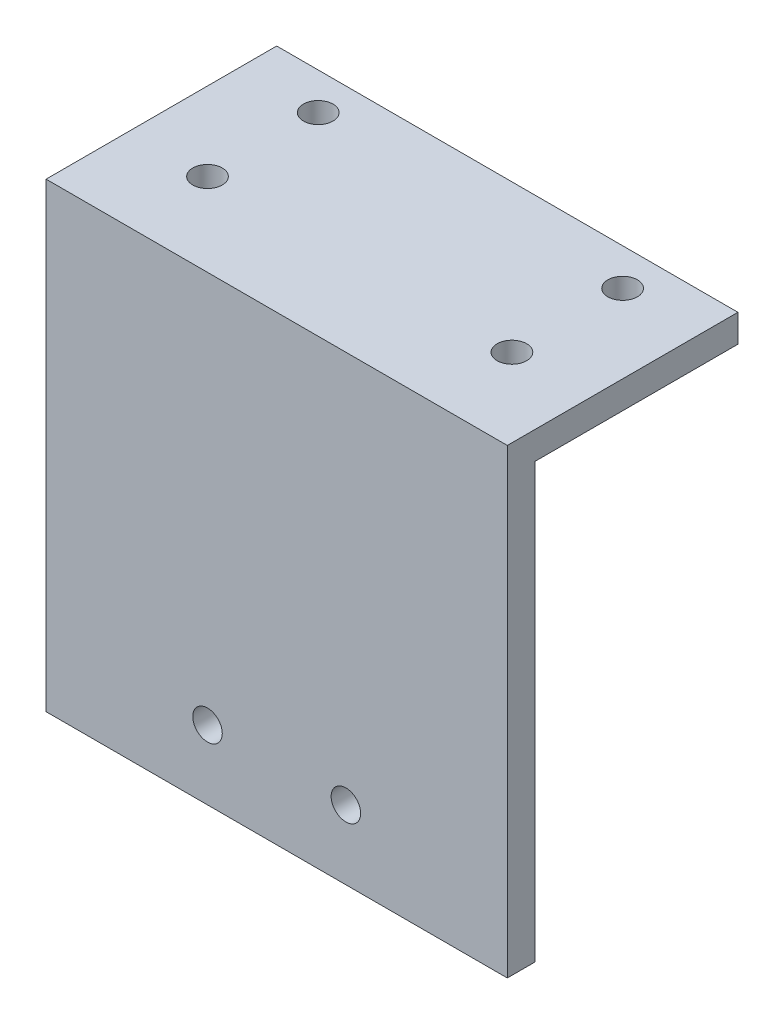
ISO-10303-21;
HEADER;
FILE_DESCRIPTION(('STEP AP214'),'2;1');
FILE_NAME('part.step','',(''),(''),'','','');
FILE_SCHEMA(('AUTOMOTIVE_DESIGN { 1 0 10303 214 1 1 1 1 }'));
ENDSEC;
DATA;
#1=APPLICATION_CONTEXT('core data for automotive mechanical design processes');
#2=APPLICATION_PROTOCOL_DEFINITION('international standard','automotive_design',2000,#1);
#3=PRODUCT_CONTEXT('',#1,'mechanical');
#4=PRODUCT('Part','Part','',(#3));
#5=PRODUCT_RELATED_PRODUCT_CATEGORY('part','',(#4));
#6=PRODUCT_DEFINITION_FORMATION('','',#4);
#7=PRODUCT_DEFINITION_CONTEXT('part definition',#1,'design');
#8=PRODUCT_DEFINITION('design','',#6,#7);
#9=PRODUCT_DEFINITION_SHAPE('','',#8);
#10=(LENGTH_UNIT() NAMED_UNIT(*) SI_UNIT(.MILLI.,.METRE.));
#11=(NAMED_UNIT(*) PLANE_ANGLE_UNIT() SI_UNIT($,.RADIAN.));
#12=(NAMED_UNIT(*) SI_UNIT($,.STERADIAN.) SOLID_ANGLE_UNIT());
#13=UNCERTAINTY_MEASURE_WITH_UNIT(LENGTH_MEASURE(1.E-05),#10,'distance_accuracy_value','');
#14=(GEOMETRIC_REPRESENTATION_CONTEXT(3) GLOBAL_UNCERTAINTY_ASSIGNED_CONTEXT((#13)) GLOBAL_UNIT_ASSIGNED_CONTEXT((#10,
#11,#12)) REPRESENTATION_CONTEXT('',''));
#15=CARTESIAN_POINT('',(0.,0.,0.));
#16=DIRECTION('',(0.,0.,1.));
#17=DIRECTION('',(1.,0.,0.));
#18=AXIS2_PLACEMENT_3D('',#15,#16,#17);
#19=CARTESIAN_POINT('',(50.,0.,0.));
#20=DIRECTION('',(0.,0.,-1.));
#21=DIRECTION('',(-1.,0.,0.));
#22=AXIS2_PLACEMENT_3D('',#19,#20,#21);
#23=PLANE('',#22);
#24=CARTESIAN_POINT('',(17.5,7.5,0.));
#25=DIRECTION('',(0.,0.,1.));
#26=DIRECTION('',(1.,0.,0.));
#27=AXIS2_PLACEMENT_3D('',#24,#25,#26);
#28=CIRCLE('',#27,1.6);
#29=CARTESIAN_POINT('',(19.1,7.5,0.));
#30=VERTEX_POINT('',#29);
#31=EDGE_CURVE('E143',#30,#30,#28,.T.);
#32=ORIENTED_EDGE('',*,*,#31,.F.);
#33=EDGE_LOOP('',(#32));
#34=FACE_BOUND('',#33,.T.);
#35=CARTESIAN_POINT('',(32.5,7.5,0.));
#36=DIRECTION('',(0.,0.,1.));
#37=DIRECTION('',(1.,0.,0.));
#38=AXIS2_PLACEMENT_3D('',#35,#36,#37);
#39=CIRCLE('',#38,1.6);
#40=CARTESIAN_POINT('',(34.1,7.5,0.));
#41=VERTEX_POINT('',#40);
#42=EDGE_CURVE('E149',#41,#41,#39,.T.);
#43=ORIENTED_EDGE('',*,*,#42,.F.);
#44=EDGE_LOOP('',(#43));
#45=FACE_BOUND('',#44,.T.);
#46=DIRECTION('',(0.,-1.,0.));
#47=VECTOR('',#46,1.);
#48=CARTESIAN_POINT('',(0.,0.,0.));
#49=LINE('',#48,#47);
#50=CARTESIAN_POINT('',(0.,50.,0.));
#51=VERTEX_POINT('',#50);
#52=CARTESIAN_POINT('',(0.,0.,0.));
#53=VERTEX_POINT('',#52);
#54=EDGE_CURVE('E125',#51,#53,#49,.T.);
#55=ORIENTED_EDGE('',*,*,#54,.T.);
#56=DIRECTION('',(-1.,0.,0.));
#57=VECTOR('',#56,1.);
#58=CARTESIAN_POINT('',(50.,0.,0.));
#59=LINE('',#58,#57);
#60=CARTESIAN_POINT('',(50.,0.,0.));
#61=VERTEX_POINT('',#60);
#62=EDGE_CURVE('E11',#61,#53,#59,.T.);
#63=ORIENTED_EDGE('',*,*,#62,.F.);
#64=DIRECTION('',(0.,-1.,0.));
#65=VECTOR('',#64,1.);
#66=CARTESIAN_POINT('',(50.,0.,0.));
#67=LINE('',#66,#65);
#68=CARTESIAN_POINT('',(50.,50.,0.));
#69=VERTEX_POINT('',#68);
#70=EDGE_CURVE('E136',#69,#61,#67,.T.);
#71=ORIENTED_EDGE('',*,*,#70,.F.);
#72=DIRECTION('',(-1.,0.,0.));
#73=VECTOR('',#72,1.);
#74=CARTESIAN_POINT('',(50.,50.,0.));
#75=LINE('',#74,#73);
#76=EDGE_CURVE('E121',#69,#51,#75,.T.);
#77=ORIENTED_EDGE('',*,*,#76,.T.);
#78=EDGE_LOOP('',(#55,#63,#71,#77));
#79=FACE_BOUND('',#78,.T.);
#80=ADVANCED_FACE('F39',(#34,#45,#79),#23,.F.);
#81=CARTESIAN_POINT('',(50.,0.,-3.));
#82=DIRECTION('',(0.,1.,0.));
#83=DIRECTION('',(0.,0.,1.));
#84=AXIS2_PLACEMENT_3D('',#81,#82,#83);
#85=PLANE('',#84);
#86=DIRECTION('',(0.,0.,-1.));
#87=VECTOR('',#86,1.);
#88=CARTESIAN_POINT('',(0.,0.,-3.));
#89=LINE('',#88,#87);
#90=CARTESIAN_POINT('',(0.,0.,-3.));
#91=VERTEX_POINT('',#90);
#92=EDGE_CURVE('E128',#53,#91,#89,.T.);
#93=ORIENTED_EDGE('',*,*,#92,.T.);
#94=DIRECTION('',(-1.,0.,0.));
#95=VECTOR('',#94,1.);
#96=CARTESIAN_POINT('',(50.,0.,-3.));
#97=LINE('',#96,#95);
#98=CARTESIAN_POINT('',(50.,0.,-3.));
#99=VERTEX_POINT('',#98);
#100=EDGE_CURVE('E48',#99,#91,#97,.T.);
#101=ORIENTED_EDGE('',*,*,#100,.F.);
#102=DIRECTION('',(0.,0.,-1.));
#103=VECTOR('',#102,1.);
#104=CARTESIAN_POINT('',(50.,0.,-3.));
#105=LINE('',#104,#103);
#106=EDGE_CURVE('E94',#61,#99,#105,.T.);
#107=ORIENTED_EDGE('',*,*,#106,.F.);
#108=ORIENTED_EDGE('',*,*,#62,.T.);
#109=EDGE_LOOP('',(#93,#101,#107,#108));
#110=FACE_BOUND('',#109,.T.);
#111=ADVANCED_FACE('F181',(#110),#85,.F.);
#112=CARTESIAN_POINT('',(50.,47.,-2.99999999999999));
#113=DIRECTION('',(0.,0.,1.));
#114=DIRECTION('',(0.,-1.,0.));
#115=AXIS2_PLACEMENT_3D('',#112,#113,#114);
#116=PLANE('',#115);
#117=CARTESIAN_POINT('',(17.5,7.5,-3.));
#118=DIRECTION('',(0.,0.,1.));
#119=DIRECTION('',(0.,-1.,0.));
#120=AXIS2_PLACEMENT_3D('',#117,#118,#119);
#121=CIRCLE('',#120,1.6);
#122=CARTESIAN_POINT('',(17.5,5.9,-3.));
#123=VERTEX_POINT('',#122);
#124=EDGE_CURVE('E42',#123,#123,#121,.T.);
#125=ORIENTED_EDGE('',*,*,#124,.T.);
#126=EDGE_LOOP('',(#125));
#127=FACE_BOUND('',#126,.T.);
#128=CARTESIAN_POINT('',(32.5,7.5,-3.));
#129=DIRECTION('',(0.,0.,1.));
#130=DIRECTION('',(0.,-1.,0.));
#131=AXIS2_PLACEMENT_3D('',#128,#129,#130);
#132=CIRCLE('',#131,1.6);
#133=CARTESIAN_POINT('',(32.5,5.9,-3.));
#134=VERTEX_POINT('',#133);
#135=EDGE_CURVE('E141',#134,#134,#132,.T.);
#136=ORIENTED_EDGE('',*,*,#135,.T.);
#137=EDGE_LOOP('',(#136));
#138=FACE_BOUND('',#137,.T.);
#139=DIRECTION('',(0.,1.,0.));
#140=VECTOR('',#139,1.);
#141=CARTESIAN_POINT('',(0.,47.,-2.99999999999999));
#142=LINE('',#141,#140);
#143=CARTESIAN_POINT('',(0.,47.,-2.99999999999999));
#144=VERTEX_POINT('',#143);
#145=EDGE_CURVE('E131',#91,#144,#142,.T.);
#146=ORIENTED_EDGE('',*,*,#145,.T.);
#147=DIRECTION('',(-1.,0.,0.));
#148=VECTOR('',#147,1.);
#149=CARTESIAN_POINT('',(50.,47.,-2.99999999999999));
#150=LINE('',#149,#148);
#151=CARTESIAN_POINT('',(50.,47.,-2.99999999999999));
#152=VERTEX_POINT('',#151);
#153=EDGE_CURVE('E116',#152,#144,#150,.T.);
#154=ORIENTED_EDGE('',*,*,#153,.F.);
#155=DIRECTION('',(0.,1.,0.));
#156=VECTOR('',#155,1.);
#157=CARTESIAN_POINT('',(50.,47.,-2.99999999999999));
#158=LINE('',#157,#156);
#159=EDGE_CURVE('E107',#99,#152,#158,.T.);
#160=ORIENTED_EDGE('',*,*,#159,.F.);
#161=ORIENTED_EDGE('',*,*,#100,.T.);
#162=EDGE_LOOP('',(#146,#154,#160,#161));
#163=FACE_BOUND('',#162,.T.);
#164=ADVANCED_FACE('F184',(#127,#138,#163),#116,.F.);
#165=CARTESIAN_POINT('',(50.,47.,-25.));
#166=DIRECTION('',(0.,1.,0.));
#167=DIRECTION('',(0.,0.,1.));
#168=AXIS2_PLACEMENT_3D('',#165,#166,#167);
#169=PLANE('',#168);
#170=CARTESIAN_POINT('',(8.5,47.,-21.));
#171=DIRECTION('',(0.,-1.,0.));
#172=DIRECTION('',(0.,0.,-1.));
#173=AXIS2_PLACEMENT_3D('',#170,#171,#172);
#174=CIRCLE('',#173,1.6);
#175=CARTESIAN_POINT('',(8.5,47.,-22.6));
#176=VERTEX_POINT('',#175);
#177=EDGE_CURVE('E166',#176,#176,#174,.T.);
#178=ORIENTED_EDGE('',*,*,#177,.F.);
#179=EDGE_LOOP('',(#178));
#180=FACE_BOUND('',#179,.T.);
#181=CARTESIAN_POINT('',(41.5,47.,-8.99999999999999));
#182=DIRECTION('',(0.,-1.,0.));
#183=DIRECTION('',(0.,0.,-1.));
#184=AXIS2_PLACEMENT_3D('',#181,#182,#183);
#185=CIRCLE('',#184,1.6);
#186=CARTESIAN_POINT('',(41.5,47.,-10.6));
#187=VERTEX_POINT('',#186);
#188=EDGE_CURVE('E159',#187,#187,#185,.T.);
#189=ORIENTED_EDGE('',*,*,#188,.F.);
#190=EDGE_LOOP('',(#189));
#191=FACE_BOUND('',#190,.T.);
#192=CARTESIAN_POINT('',(41.5,47.,-21.));
#193=DIRECTION('',(0.,-1.,0.));
#194=DIRECTION('',(0.,0.,-1.));
#195=AXIS2_PLACEMENT_3D('',#192,#193,#194);
#196=CIRCLE('',#195,1.6);
#197=CARTESIAN_POINT('',(41.5,47.,-22.6));
#198=VERTEX_POINT('',#197);
#199=EDGE_CURVE('E147',#198,#198,#196,.T.);
#200=ORIENTED_EDGE('',*,*,#199,.F.);
#201=EDGE_LOOP('',(#200));
#202=FACE_BOUND('',#201,.T.);
#203=CARTESIAN_POINT('',(8.5,47.,-8.99999999999999));
#204=DIRECTION('',(0.,-1.,0.));
#205=DIRECTION('',(0.,0.,-1.));
#206=AXIS2_PLACEMENT_3D('',#203,#204,#205);
#207=CIRCLE('',#206,1.6);
#208=CARTESIAN_POINT('',(8.5,47.,-10.6));
#209=VERTEX_POINT('',#208);
#210=EDGE_CURVE('E165',#209,#209,#207,.T.);
#211=ORIENTED_EDGE('',*,*,#210,.F.);
#212=EDGE_LOOP('',(#211));
#213=FACE_BOUND('',#212,.T.);
#214=DIRECTION('',(0.,0.,-1.));
#215=VECTOR('',#214,1.);
#216=CARTESIAN_POINT('',(0.,47.,-25.));
#217=LINE('',#216,#215);
#218=CARTESIAN_POINT('',(0.,47.,-25.));
#219=VERTEX_POINT('',#218);
#220=EDGE_CURVE('E115',#144,#219,#217,.T.);
#221=ORIENTED_EDGE('',*,*,#220,.T.);
#222=DIRECTION('',(-1.,0.,0.));
#223=VECTOR('',#222,1.);
#224=CARTESIAN_POINT('',(50.,47.,-25.));
#225=LINE('',#224,#223);
#226=CARTESIAN_POINT('',(50.,47.,-25.));
#227=VERTEX_POINT('',#226);
#228=EDGE_CURVE('E112',#227,#219,#225,.T.);
#229=ORIENTED_EDGE('',*,*,#228,.F.);
#230=DIRECTION('',(0.,0.,-1.));
#231=VECTOR('',#230,1.);
#232=CARTESIAN_POINT('',(50.,47.,-25.));
#233=LINE('',#232,#231);
#234=EDGE_CURVE('E101',#152,#227,#233,.T.);
#235=ORIENTED_EDGE('',*,*,#234,.F.);
#236=ORIENTED_EDGE('',*,*,#153,.T.);
#237=EDGE_LOOP('',(#221,#229,#235,#236));
#238=FACE_BOUND('',#237,.T.);
#239=ADVANCED_FACE('F113',(#180,#191,#202,#213,#238),#169,.F.);
#240=CARTESIAN_POINT('',(50.,50.,-25.));
#241=DIRECTION('',(0.,0.,1.));
#242=DIRECTION('',(0.,-1.,0.));
#243=AXIS2_PLACEMENT_3D('',#240,#241,#242);
#244=PLANE('',#243);
#245=DIRECTION('',(0.,1.,0.));
#246=VECTOR('',#245,1.);
#247=CARTESIAN_POINT('',(0.,50.,-25.));
#248=LINE('',#247,#246);
#249=CARTESIAN_POINT('',(0.,50.,-25.));
#250=VERTEX_POINT('',#249);
#251=EDGE_CURVE('E80',#219,#250,#248,.T.);
#252=ORIENTED_EDGE('',*,*,#251,.T.);
#253=DIRECTION('',(-1.,0.,0.));
#254=VECTOR('',#253,1.);
#255=CARTESIAN_POINT('',(50.,50.,-25.));
#256=LINE('',#255,#254);
#257=CARTESIAN_POINT('',(50.,50.,-25.));
#258=VERTEX_POINT('',#257);
#259=EDGE_CURVE('E117',#258,#250,#256,.T.);
#260=ORIENTED_EDGE('',*,*,#259,.F.);
#261=DIRECTION('',(0.,1.,0.));
#262=VECTOR('',#261,1.);
#263=CARTESIAN_POINT('',(50.,50.,-25.));
#264=LINE('',#263,#262);
#265=EDGE_CURVE('E105',#227,#258,#264,.T.);
#266=ORIENTED_EDGE('',*,*,#265,.F.);
#267=ORIENTED_EDGE('',*,*,#228,.T.);
#268=EDGE_LOOP('',(#252,#260,#266,#267));
#269=FACE_BOUND('',#268,.T.);
#270=ADVANCED_FACE('F119',(#269),#244,.F.);
#271=CARTESIAN_POINT('',(50.,50.,0.));
#272=DIRECTION('',(0.,-1.,0.));
#273=DIRECTION('',(0.,0.,-1.));
#274=AXIS2_PLACEMENT_3D('',#271,#272,#273);
#275=PLANE('',#274);
#276=CARTESIAN_POINT('',(8.5,50.,-21.));
#277=DIRECTION('',(0.,-1.,0.));
#278=DIRECTION('',(0.,0.,-1.));
#279=AXIS2_PLACEMENT_3D('',#276,#277,#278);
#280=CIRCLE('',#279,1.6);
#281=CARTESIAN_POINT('',(8.5,50.,-22.6));
#282=VERTEX_POINT('',#281);
#283=EDGE_CURVE('E162',#282,#282,#280,.T.);
#284=ORIENTED_EDGE('',*,*,#283,.T.);
#285=EDGE_LOOP('',(#284));
#286=FACE_BOUND('',#285,.T.);
#287=CARTESIAN_POINT('',(41.5,50.,-8.99999999999999));
#288=DIRECTION('',(0.,-1.,0.));
#289=DIRECTION('',(0.,0.,-1.));
#290=AXIS2_PLACEMENT_3D('',#287,#288,#289);
#291=CIRCLE('',#290,1.6);
#292=CARTESIAN_POINT('',(41.5,50.,-10.6));
#293=VERTEX_POINT('',#292);
#294=EDGE_CURVE('E169',#293,#293,#291,.T.);
#295=ORIENTED_EDGE('',*,*,#294,.T.);
#296=EDGE_LOOP('',(#295));
#297=FACE_BOUND('',#296,.T.);
#298=CARTESIAN_POINT('',(41.5,50.,-21.));
#299=DIRECTION('',(0.,-1.,0.));
#300=DIRECTION('',(0.,0.,-1.));
#301=AXIS2_PLACEMENT_3D('',#298,#299,#300);
#302=CIRCLE('',#301,1.6);
#303=CARTESIAN_POINT('',(41.5,50.,-22.6));
#304=VERTEX_POINT('',#303);
#305=EDGE_CURVE('E156',#304,#304,#302,.T.);
#306=ORIENTED_EDGE('',*,*,#305,.T.);
#307=EDGE_LOOP('',(#306));
#308=FACE_BOUND('',#307,.T.);
#309=CARTESIAN_POINT('',(8.5,50.,-8.99999999999999));
#310=DIRECTION('',(0.,-1.,0.));
#311=DIRECTION('',(0.,0.,-1.));
#312=AXIS2_PLACEMENT_3D('',#309,#310,#311);
#313=CIRCLE('',#312,1.6);
#314=CARTESIAN_POINT('',(8.5,50.,-10.6));
#315=VERTEX_POINT('',#314);
#316=EDGE_CURVE('E129',#315,#315,#313,.T.);
#317=ORIENTED_EDGE('',*,*,#316,.T.);
#318=EDGE_LOOP('',(#317));
#319=FACE_BOUND('',#318,.T.);
#320=DIRECTION('',(0.,0.,1.));
#321=VECTOR('',#320,1.);
#322=CARTESIAN_POINT('',(0.,50.,0.));
#323=LINE('',#322,#321);
#324=EDGE_CURVE('E86',#250,#51,#323,.T.);
#325=ORIENTED_EDGE('',*,*,#324,.T.);
#326=ORIENTED_EDGE('',*,*,#76,.F.);
#327=DIRECTION('',(0.,0.,1.));
#328=VECTOR('',#327,1.);
#329=CARTESIAN_POINT('',(50.,50.,0.));
#330=LINE('',#329,#328);
#331=EDGE_CURVE('E57',#258,#69,#330,.T.);
#332=ORIENTED_EDGE('',*,*,#331,.F.);
#333=ORIENTED_EDGE('',*,*,#259,.T.);
#334=EDGE_LOOP('',(#325,#326,#332,#333));
#335=FACE_BOUND('',#334,.T.);
#336=ADVANCED_FACE('F189',(#286,#297,#308,#319,#335),#275,.F.);
#337=CARTESIAN_POINT('',(50.,0.,0.));
#338=DIRECTION('',(-1.,0.,0.));
#339=DIRECTION('',(0.,0.,1.));
#340=AXIS2_PLACEMENT_3D('',#337,#338,#339);
#341=PLANE('',#340);
#342=ORIENTED_EDGE('',*,*,#70,.T.);
#343=ORIENTED_EDGE('',*,*,#106,.T.);
#344=ORIENTED_EDGE('',*,*,#159,.T.);
#345=ORIENTED_EDGE('',*,*,#234,.T.);
#346=ORIENTED_EDGE('',*,*,#265,.T.);
#347=ORIENTED_EDGE('',*,*,#331,.T.);
#348=EDGE_LOOP('',(#342,#343,#344,#345,#346,#347));
#349=FACE_BOUND('',#348,.T.);
#350=ADVANCED_FACE('F103',(#349),#341,.F.);
#351=CARTESIAN_POINT('',(0.,0.,0.));
#352=DIRECTION('',(-1.,0.,0.));
#353=DIRECTION('',(0.,0.,1.));
#354=AXIS2_PLACEMENT_3D('',#351,#352,#353);
#355=PLANE('',#354);
#356=ORIENTED_EDGE('',*,*,#54,.F.);
#357=ORIENTED_EDGE('',*,*,#324,.F.);
#358=ORIENTED_EDGE('',*,*,#251,.F.);
#359=ORIENTED_EDGE('',*,*,#220,.F.);
#360=ORIENTED_EDGE('',*,*,#145,.F.);
#361=ORIENTED_EDGE('',*,*,#92,.F.);
#362=EDGE_LOOP('',(#356,#357,#358,#359,#360,#361));
#363=FACE_BOUND('',#362,.T.);
#364=ADVANCED_FACE('F187',(#363),#355,.T.);
#365=CARTESIAN_POINT('',(8.5,50.,-8.99999999999999));
#366=DIRECTION('',(0.,-1.,0.));
#367=DIRECTION('',(0.,0.,-1.));
#368=AXIS2_PLACEMENT_3D('',#365,#366,#367);
#369=CYLINDRICAL_SURFACE('',#368,1.6);
#370=ORIENTED_EDGE('',*,*,#316,.F.);
#371=EDGE_LOOP('',(#370));
#372=FACE_BOUND('',#371,.T.);
#373=ORIENTED_EDGE('',*,*,#210,.T.);
#374=EDGE_LOOP('',(#373));
#375=FACE_BOUND('',#374,.T.);
#376=ADVANCED_FACE('F226',(#372,#375),#369,.F.);
#377=CARTESIAN_POINT('',(41.5,50.,-21.));
#378=DIRECTION('',(0.,-1.,0.));
#379=DIRECTION('',(0.,0.,-1.));
#380=AXIS2_PLACEMENT_3D('',#377,#378,#379);
#381=CYLINDRICAL_SURFACE('',#380,1.6);
#382=ORIENTED_EDGE('',*,*,#305,.F.);
#383=EDGE_LOOP('',(#382));
#384=FACE_BOUND('',#383,.T.);
#385=ORIENTED_EDGE('',*,*,#199,.T.);
#386=EDGE_LOOP('',(#385));
#387=FACE_BOUND('',#386,.T.);
#388=ADVANCED_FACE('F224',(#384,#387),#381,.F.);
#389=CARTESIAN_POINT('',(41.5,50.,-8.99999999999999));
#390=DIRECTION('',(0.,-1.,0.));
#391=DIRECTION('',(0.,0.,-1.));
#392=AXIS2_PLACEMENT_3D('',#389,#390,#391);
#393=CYLINDRICAL_SURFACE('',#392,1.6);
#394=ORIENTED_EDGE('',*,*,#294,.F.);
#395=EDGE_LOOP('',(#394));
#396=FACE_BOUND('',#395,.T.);
#397=ORIENTED_EDGE('',*,*,#188,.T.);
#398=EDGE_LOOP('',(#397));
#399=FACE_BOUND('',#398,.T.);
#400=ADVANCED_FACE('F220',(#396,#399),#393,.F.);
#401=CARTESIAN_POINT('',(8.5,50.,-21.));
#402=DIRECTION('',(0.,-1.,0.));
#403=DIRECTION('',(0.,0.,-1.));
#404=AXIS2_PLACEMENT_3D('',#401,#402,#403);
#405=CYLINDRICAL_SURFACE('',#404,1.6);
#406=ORIENTED_EDGE('',*,*,#283,.F.);
#407=EDGE_LOOP('',(#406));
#408=FACE_BOUND('',#407,.T.);
#409=ORIENTED_EDGE('',*,*,#177,.T.);
#410=EDGE_LOOP('',(#409));
#411=FACE_BOUND('',#410,.T.);
#412=ADVANCED_FACE('F213',(#408,#411),#405,.F.);
#413=CARTESIAN_POINT('',(32.5,7.5,-25.));
#414=DIRECTION('',(0.,0.,1.));
#415=DIRECTION('',(1.,0.,0.));
#416=AXIS2_PLACEMENT_3D('',#413,#414,#415);
#417=CYLINDRICAL_SURFACE('',#416,1.6);
#418=ORIENTED_EDGE('',*,*,#42,.T.);
#419=EDGE_LOOP('',(#418));
#420=FACE_BOUND('',#419,.T.);
#421=ORIENTED_EDGE('',*,*,#135,.F.);
#422=EDGE_LOOP('',(#421));
#423=FACE_BOUND('',#422,.T.);
#424=ADVANCED_FACE('F209',(#420,#423),#417,.F.);
#425=CARTESIAN_POINT('',(17.5,7.5,-25.));
#426=DIRECTION('',(0.,0.,1.));
#427=DIRECTION('',(1.,0.,0.));
#428=AXIS2_PLACEMENT_3D('',#425,#426,#427);
#429=CYLINDRICAL_SURFACE('',#428,1.6);
#430=ORIENTED_EDGE('',*,*,#31,.T.);
#431=EDGE_LOOP('',(#430));
#432=FACE_BOUND('',#431,.T.);
#433=ORIENTED_EDGE('',*,*,#124,.F.);
#434=EDGE_LOOP('',(#433));
#435=FACE_BOUND('',#434,.T.);
#436=ADVANCED_FACE('F212',(#432,#435),#429,.F.);
#437=CLOSED_SHELL('',(#80,#111,#164,#239,#270,#336,#350,#364,#376,#388,#400,#412,#424,#436));
#438=MANIFOLD_SOLID_BREP('B2',#437);
#439=ADVANCED_BREP_SHAPE_REPRESENTATION('',(#18,#438),#14);
#440=SHAPE_DEFINITION_REPRESENTATION(#9,#439);
ENDSEC;
END-ISO-10303-21;
